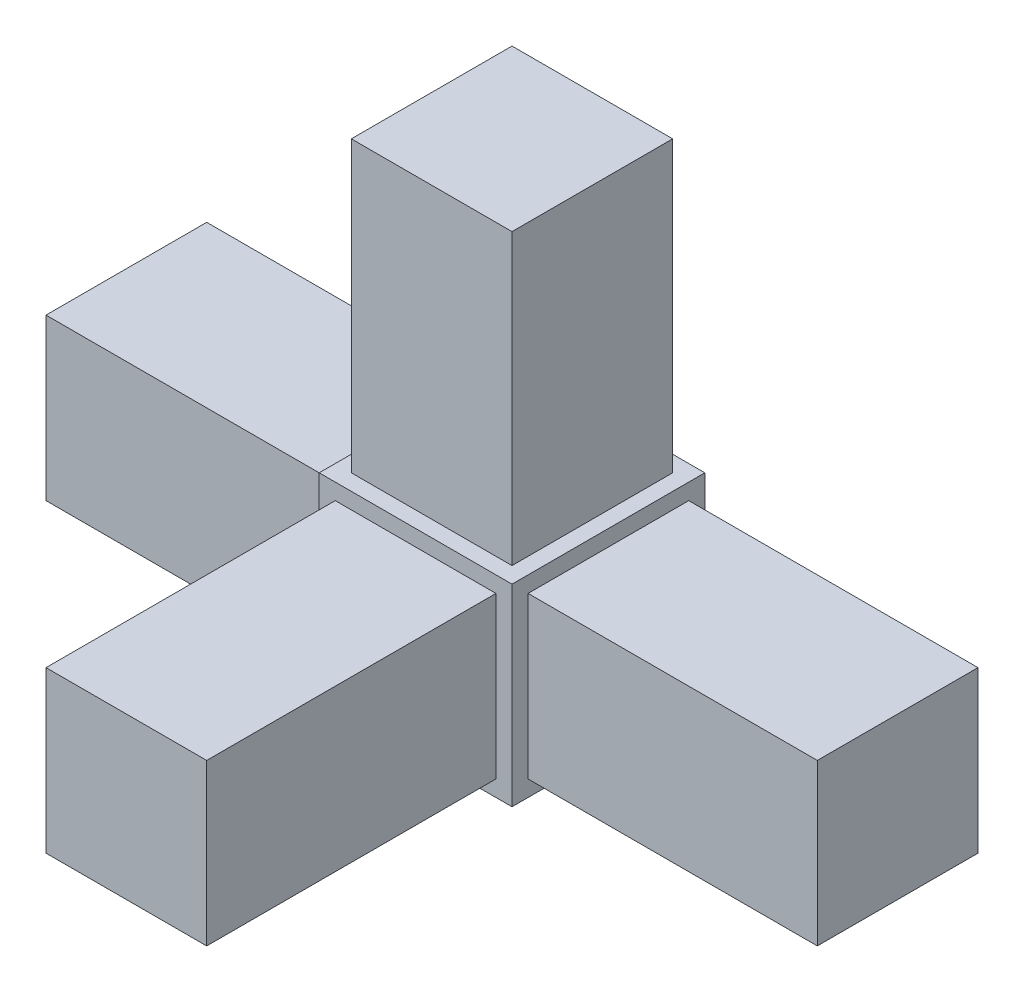
ISO-10303-21;
HEADER;
FILE_DESCRIPTION(('STEP AP214'),'2;1');
FILE_NAME('part.step','',(''),(''),'','','');
FILE_SCHEMA(('AUTOMOTIVE_DESIGN { 1 0 10303 214 1 1 1 1 }'));
ENDSEC;
DATA;
#1=APPLICATION_CONTEXT('core data for automotive mechanical design processes');
#2=APPLICATION_PROTOCOL_DEFINITION('international standard','automotive_design',2000,#1);
#3=PRODUCT_CONTEXT('',#1,'mechanical');
#4=PRODUCT('Part','Part','',(#3));
#5=PRODUCT_RELATED_PRODUCT_CATEGORY('part','',(#4));
#6=PRODUCT_DEFINITION_FORMATION('','',#4);
#7=PRODUCT_DEFINITION_CONTEXT('part definition',#1,'design');
#8=PRODUCT_DEFINITION('design','',#6,#7);
#9=PRODUCT_DEFINITION_SHAPE('','',#8);
#10=(LENGTH_UNIT() NAMED_UNIT(*) SI_UNIT(.MILLI.,.METRE.));
#11=(NAMED_UNIT(*) PLANE_ANGLE_UNIT() SI_UNIT($,.RADIAN.));
#12=(NAMED_UNIT(*) SI_UNIT($,.STERADIAN.) SOLID_ANGLE_UNIT());
#13=UNCERTAINTY_MEASURE_WITH_UNIT(LENGTH_MEASURE(1.E-05),#10,'distance_accuracy_value','');
#14=(GEOMETRIC_REPRESENTATION_CONTEXT(3) GLOBAL_UNCERTAINTY_ASSIGNED_CONTEXT((#13)) GLOBAL_UNIT_ASSIGNED_CONTEXT((#10,
#11,#12)) REPRESENTATION_CONTEXT('',''));
#15=CARTESIAN_POINT('',(0.,0.,0.));
#16=DIRECTION('',(0.,0.,1.));
#17=DIRECTION('',(1.,0.,0.));
#18=AXIS2_PLACEMENT_3D('',#15,#16,#17);
#19=CARTESIAN_POINT('',(-9.525,-9.525,19.05));
#20=DIRECTION('',(1.,0.,0.));
#21=DIRECTION('',(0.,0.,-1.));
#22=AXIS2_PLACEMENT_3D('',#19,#20,#21);
#23=PLANE('',#22);
#24=DIRECTION('',(0.,-1.,0.));
#25=VECTOR('',#24,1.);
#26=CARTESIAN_POINT('',(-9.525,-9.525,0.));
#27=LINE('',#26,#25);
#28=CARTESIAN_POINT('',(-9.525,9.525,0.));
#29=VERTEX_POINT('',#28);
#30=CARTESIAN_POINT('',(-9.525,-9.525,0.));
#31=VERTEX_POINT('',#30);
#32=EDGE_CURVE('E290',#29,#31,#27,.T.);
#33=ORIENTED_EDGE('',*,*,#32,.T.);
#34=DIRECTION('',(0.,0.,-1.));
#35=VECTOR('',#34,1.);
#36=CARTESIAN_POINT('',(-9.525,-9.525,19.05));
#37=LINE('',#36,#35);
#38=CARTESIAN_POINT('',(-9.525,-9.525,19.05));
#39=VERTEX_POINT('',#38);
#40=EDGE_CURVE('E11',#39,#31,#37,.T.);
#41=ORIENTED_EDGE('',*,*,#40,.F.);
#42=DIRECTION('',(0.,-1.,0.));
#43=VECTOR('',#42,1.);
#44=CARTESIAN_POINT('',(-9.525,-9.525,19.05));
#45=LINE('',#44,#43);
#46=CARTESIAN_POINT('',(-9.525,9.525,19.05));
#47=VERTEX_POINT('',#46);
#48=EDGE_CURVE('E291',#47,#39,#45,.T.);
#49=ORIENTED_EDGE('',*,*,#48,.F.);
#50=DIRECTION('',(0.,0.,-1.));
#51=VECTOR('',#50,1.);
#52=CARTESIAN_POINT('',(-9.525,9.525,19.05));
#53=LINE('',#52,#51);
#54=EDGE_CURVE('E301',#47,#29,#53,.T.);
#55=ORIENTED_EDGE('',*,*,#54,.T.);
#56=EDGE_LOOP('',(#33,#41,#49,#55));
#57=FACE_BOUND('',#56,.T.);
#58=DIRECTION('',(0.,-1.,0.));
#59=VECTOR('',#58,1.);
#60=CARTESIAN_POINT('',(-9.525,7.9375,1.5875));
#61=LINE('',#60,#59);
#62=CARTESIAN_POINT('',(-9.525,7.9375,1.5875));
#63=VERTEX_POINT('',#62);
#64=CARTESIAN_POINT('',(-9.525,-7.9375,1.58750000000001));
#65=VERTEX_POINT('',#64);
#66=EDGE_CURVE('E189',#63,#65,#61,.T.);
#67=ORIENTED_EDGE('',*,*,#66,.F.);
#68=DIRECTION('',(0.,0.,-1.));
#69=VECTOR('',#68,1.);
#70=CARTESIAN_POINT('',(-9.525,7.9375,1.5875));
#71=LINE('',#70,#69);
#72=CARTESIAN_POINT('',(-9.525,7.9375,17.4625));
#73=VERTEX_POINT('',#72);
#74=EDGE_CURVE('E186',#73,#63,#71,.T.);
#75=ORIENTED_EDGE('',*,*,#74,.F.);
#76=DIRECTION('',(0.,1.,0.));
#77=VECTOR('',#76,1.);
#78=CARTESIAN_POINT('',(-9.525,7.9375,17.4625));
#79=LINE('',#78,#77);
#80=CARTESIAN_POINT('',(-9.525,-7.9375,17.4625));
#81=VERTEX_POINT('',#80);
#82=EDGE_CURVE('E52',#81,#73,#79,.T.);
#83=ORIENTED_EDGE('',*,*,#82,.F.);
#84=DIRECTION('',(0.,0.,1.));
#85=VECTOR('',#84,1.);
#86=CARTESIAN_POINT('',(-9.525,-7.9375,1.58750000000001));
#87=LINE('',#86,#85);
#88=EDGE_CURVE('E47',#65,#81,#87,.T.);
#89=ORIENTED_EDGE('',*,*,#88,.F.);
#90=EDGE_LOOP('',(#67,#75,#83,#89));
#91=FACE_BOUND('',#90,.T.);
#92=ADVANCED_FACE('F33',(#57,#91),#23,.F.);
#93=CARTESIAN_POINT('',(0.,0.,19.05));
#94=DIRECTION('',(0.,0.,1.));
#95=DIRECTION('',(1.,0.,0.));
#96=AXIS2_PLACEMENT_3D('',#93,#94,#95);
#97=PLANE('',#96);
#98=ORIENTED_EDGE('',*,*,#48,.T.);
#99=DIRECTION('',(1.,0.,0.));
#100=VECTOR('',#99,1.);
#101=CARTESIAN_POINT('',(9.525,-9.525,19.05));
#102=LINE('',#101,#100);
#103=CARTESIAN_POINT('',(9.525,-9.525,19.05));
#104=VERTEX_POINT('',#103);
#105=EDGE_CURVE('E294',#39,#104,#102,.T.);
#106=ORIENTED_EDGE('',*,*,#105,.T.);
#107=DIRECTION('',(0.,1.,0.));
#108=VECTOR('',#107,1.);
#109=CARTESIAN_POINT('',(9.525,-9.525,19.05));
#110=LINE('',#109,#108);
#111=CARTESIAN_POINT('',(9.525,9.525,19.05));
#112=VERTEX_POINT('',#111);
#113=EDGE_CURVE('E297',#104,#112,#110,.T.);
#114=ORIENTED_EDGE('',*,*,#113,.T.);
#115=DIRECTION('',(-1.,0.,0.));
#116=VECTOR('',#115,1.);
#117=CARTESIAN_POINT('',(9.525,9.525,19.05));
#118=LINE('',#117,#116);
#119=EDGE_CURVE('E299',#112,#47,#118,.T.);
#120=ORIENTED_EDGE('',*,*,#119,.T.);
#121=EDGE_LOOP('',(#98,#106,#114,#120));
#122=FACE_BOUND('',#121,.T.);
#123=DIRECTION('',(1.,0.,0.));
#124=VECTOR('',#123,1.);
#125=CARTESIAN_POINT('',(7.9375,-7.9375,19.05));
#126=LINE('',#125,#124);
#127=CARTESIAN_POINT('',(-7.9375,-7.9375,19.05));
#128=VERTEX_POINT('',#127);
#129=CARTESIAN_POINT('',(7.9375,-7.9375,19.05));
#130=VERTEX_POINT('',#129);
#131=EDGE_CURVE('E193',#128,#130,#126,.T.);
#132=ORIENTED_EDGE('',*,*,#131,.F.);
#133=DIRECTION('',(0.,-1.,0.));
#134=VECTOR('',#133,1.);
#135=CARTESIAN_POINT('',(-7.9375,-7.9375,19.05));
#136=LINE('',#135,#134);
#137=CARTESIAN_POINT('',(-7.9375,7.9375,19.05));
#138=VERTEX_POINT('',#137);
#139=EDGE_CURVE('E190',#138,#128,#136,.T.);
#140=ORIENTED_EDGE('',*,*,#139,.F.);
#141=DIRECTION('',(-1.,0.,0.));
#142=VECTOR('',#141,1.);
#143=CARTESIAN_POINT('',(7.9375,7.9375,19.05));
#144=LINE('',#143,#142);
#145=CARTESIAN_POINT('',(7.9375,7.9375,19.05));
#146=VERTEX_POINT('',#145);
#147=EDGE_CURVE('E203',#146,#138,#144,.T.);
#148=ORIENTED_EDGE('',*,*,#147,.F.);
#149=DIRECTION('',(0.,1.,0.));
#150=VECTOR('',#149,1.);
#151=CARTESIAN_POINT('',(7.9375,-7.9375,19.05));
#152=LINE('',#151,#150);
#153=EDGE_CURVE('E211',#130,#146,#152,.T.);
#154=ORIENTED_EDGE('',*,*,#153,.F.);
#155=EDGE_LOOP('',(#132,#140,#148,#154));
#156=FACE_BOUND('',#155,.T.);
#157=ADVANCED_FACE('F335',(#122,#156),#97,.T.);
#158=CARTESIAN_POINT('',(9.525,-9.525,19.05));
#159=DIRECTION('',(-1.,0.,0.));
#160=DIRECTION('',(0.,0.,1.));
#161=AXIS2_PLACEMENT_3D('',#158,#159,#160);
#162=PLANE('',#161);
#163=DIRECTION('',(0.,1.,0.));
#164=VECTOR('',#163,1.);
#165=CARTESIAN_POINT('',(9.525,-9.525,0.));
#166=LINE('',#165,#164);
#167=CARTESIAN_POINT('',(9.525,-9.525,0.));
#168=VERTEX_POINT('',#167);
#169=CARTESIAN_POINT('',(9.525,9.525,0.));
#170=VERTEX_POINT('',#169);
#171=EDGE_CURVE('E306',#168,#170,#166,.T.);
#172=ORIENTED_EDGE('',*,*,#171,.T.);
#173=DIRECTION('',(0.,0.,-1.));
#174=VECTOR('',#173,1.);
#175=CARTESIAN_POINT('',(9.525,9.525,19.05));
#176=LINE('',#175,#174);
#177=EDGE_CURVE('E311',#112,#170,#176,.T.);
#178=ORIENTED_EDGE('',*,*,#177,.F.);
#179=ORIENTED_EDGE('',*,*,#113,.F.);
#180=DIRECTION('',(0.,0.,-1.));
#181=VECTOR('',#180,1.);
#182=CARTESIAN_POINT('',(9.525,-9.525,19.05));
#183=LINE('',#182,#181);
#184=EDGE_CURVE('E40',#104,#168,#183,.T.);
#185=ORIENTED_EDGE('',*,*,#184,.T.);
#186=EDGE_LOOP('',(#172,#178,#179,#185));
#187=FACE_BOUND('',#186,.T.);
#188=DIRECTION('',(0.,1.,0.));
#189=VECTOR('',#188,1.);
#190=CARTESIAN_POINT('',(9.525,-7.9375,1.5875));
#191=LINE('',#190,#189);
#192=CARTESIAN_POINT('',(9.525,-7.9375,1.5875));
#193=VERTEX_POINT('',#192);
#194=CARTESIAN_POINT('',(9.525,7.9375,1.5875));
#195=VERTEX_POINT('',#194);
#196=EDGE_CURVE('E224',#193,#195,#191,.T.);
#197=ORIENTED_EDGE('',*,*,#196,.F.);
#198=DIRECTION('',(0.,0.,-1.));
#199=VECTOR('',#198,1.);
#200=CARTESIAN_POINT('',(9.525,-7.9375,17.4625));
#201=LINE('',#200,#199);
#202=CARTESIAN_POINT('',(9.525,-7.9375,17.4625));
#203=VERTEX_POINT('',#202);
#204=EDGE_CURVE('E229',#203,#193,#201,.T.);
#205=ORIENTED_EDGE('',*,*,#204,.F.);
#206=DIRECTION('',(0.,-1.,0.));
#207=VECTOR('',#206,1.);
#208=CARTESIAN_POINT('',(9.525,-7.9375,17.4625));
#209=LINE('',#208,#207);
#210=CARTESIAN_POINT('',(9.525,7.9375,17.4625));
#211=VERTEX_POINT('',#210);
#212=EDGE_CURVE('E241',#211,#203,#209,.T.);
#213=ORIENTED_EDGE('',*,*,#212,.F.);
#214=DIRECTION('',(0.,0.,1.));
#215=VECTOR('',#214,1.);
#216=CARTESIAN_POINT('',(9.525,7.9375,17.4625));
#217=LINE('',#216,#215);
#218=EDGE_CURVE('E238',#195,#211,#217,.T.);
#219=ORIENTED_EDGE('',*,*,#218,.F.);
#220=EDGE_LOOP('',(#197,#205,#213,#219));
#221=FACE_BOUND('',#220,.T.);
#222=ADVANCED_FACE('F318',(#187,#221),#162,.F.);
#223=CARTESIAN_POINT('',(9.525,9.525,19.05));
#224=DIRECTION('',(0.,-1.,0.));
#225=DIRECTION('',(1.,0.,0.));
#226=AXIS2_PLACEMENT_3D('',#223,#224,#225);
#227=PLANE('',#226);
#228=DIRECTION('',(-1.,0.,0.));
#229=VECTOR('',#228,1.);
#230=CARTESIAN_POINT('',(9.525,9.525,0.));
#231=LINE('',#230,#229);
#232=EDGE_CURVE('E295',#170,#29,#231,.T.);
#233=ORIENTED_EDGE('',*,*,#232,.T.);
#234=ORIENTED_EDGE('',*,*,#54,.F.);
#235=ORIENTED_EDGE('',*,*,#119,.F.);
#236=ORIENTED_EDGE('',*,*,#177,.T.);
#237=EDGE_LOOP('',(#233,#234,#235,#236));
#238=FACE_BOUND('',#237,.T.);
#239=DIRECTION('',(0.,0.,-1.));
#240=VECTOR('',#239,1.);
#241=CARTESIAN_POINT('',(7.9375,9.525,1.5875));
#242=LINE('',#241,#240);
#243=CARTESIAN_POINT('',(7.9375,9.525,17.4625));
#244=VERTEX_POINT('',#243);
#245=CARTESIAN_POINT('',(7.9375,9.525,1.5875));
#246=VERTEX_POINT('',#245);
#247=EDGE_CURVE('E257',#244,#246,#242,.T.);
#248=ORIENTED_EDGE('',*,*,#247,.F.);
#249=DIRECTION('',(1.,0.,0.));
#250=VECTOR('',#249,1.);
#251=CARTESIAN_POINT('',(-7.9375,9.525,17.4625));
#252=LINE('',#251,#250);
#253=CARTESIAN_POINT('',(-7.9375,9.525,17.4625));
#254=VERTEX_POINT('',#253);
#255=EDGE_CURVE('E262',#254,#244,#252,.T.);
#256=ORIENTED_EDGE('',*,*,#255,.F.);
#257=DIRECTION('',(0.,0.,1.));
#258=VECTOR('',#257,1.);
#259=CARTESIAN_POINT('',(-7.9375,9.525,1.5875));
#260=LINE('',#259,#258);
#261=CARTESIAN_POINT('',(-7.9375,9.525,1.58750000000001));
#262=VERTEX_POINT('',#261);
#263=EDGE_CURVE('E274',#262,#254,#260,.T.);
#264=ORIENTED_EDGE('',*,*,#263,.F.);
#265=DIRECTION('',(-1.,0.,0.));
#266=VECTOR('',#265,1.);
#267=CARTESIAN_POINT('',(-7.9375,9.525,1.5875));
#268=LINE('',#267,#266);
#269=EDGE_CURVE('E271',#246,#262,#268,.T.);
#270=ORIENTED_EDGE('',*,*,#269,.F.);
#271=EDGE_LOOP('',(#248,#256,#264,#270));
#272=FACE_BOUND('',#271,.T.);
#273=ADVANCED_FACE('F328',(#238,#272),#227,.F.);
#274=CARTESIAN_POINT('',(9.525,-9.525,19.05));
#275=DIRECTION('',(0.,1.,0.));
#276=DIRECTION('',(-1.,0.,0.));
#277=AXIS2_PLACEMENT_3D('',#274,#275,#276);
#278=PLANE('',#277);
#279=DIRECTION('',(1.,0.,0.));
#280=VECTOR('',#279,1.);
#281=CARTESIAN_POINT('',(9.525,-9.525,0.));
#282=LINE('',#281,#280);
#283=EDGE_CURVE('E304',#31,#168,#282,.T.);
#284=ORIENTED_EDGE('',*,*,#283,.T.);
#285=ORIENTED_EDGE('',*,*,#184,.F.);
#286=ORIENTED_EDGE('',*,*,#105,.F.);
#287=ORIENTED_EDGE('',*,*,#40,.T.);
#288=EDGE_LOOP('',(#284,#285,#286,#287));
#289=FACE_BOUND('',#288,.T.);
#290=ADVANCED_FACE('F337',(#289),#278,.F.);
#291=CARTESIAN_POINT('',(0.,0.,0.));
#292=DIRECTION('',(0.,0.,1.));
#293=DIRECTION('',(1.,0.,0.));
#294=AXIS2_PLACEMENT_3D('',#291,#292,#293);
#295=PLANE('',#294);
#296=ORIENTED_EDGE('',*,*,#32,.F.);
#297=ORIENTED_EDGE('',*,*,#232,.F.);
#298=ORIENTED_EDGE('',*,*,#171,.F.);
#299=ORIENTED_EDGE('',*,*,#283,.F.);
#300=EDGE_LOOP('',(#296,#297,#298,#299));
#301=FACE_BOUND('',#300,.T.);
#302=ADVANCED_FACE('F325',(#301),#295,.F.);
#303=CARTESIAN_POINT('',(7.9375,38.1,1.5875));
#304=DIRECTION('',(-1.,0.,0.));
#305=DIRECTION('',(0.,0.,1.));
#306=AXIS2_PLACEMENT_3D('',#303,#304,#305);
#307=PLANE('',#306);
#308=ORIENTED_EDGE('',*,*,#247,.T.);
#309=DIRECTION('',(0.,-1.,0.));
#310=VECTOR('',#309,1.);
#311=CARTESIAN_POINT('',(7.9375,38.1,1.5875));
#312=LINE('',#311,#310);
#313=CARTESIAN_POINT('',(7.9375,38.1,1.5875));
#314=VERTEX_POINT('',#313);
#315=EDGE_CURVE('E287',#314,#246,#312,.T.);
#316=ORIENTED_EDGE('',*,*,#315,.F.);
#317=DIRECTION('',(0.,0.,-1.));
#318=VECTOR('',#317,1.);
#319=CARTESIAN_POINT('',(7.9375,38.1,1.5875));
#320=LINE('',#319,#318);
#321=CARTESIAN_POINT('',(7.9375,38.1,17.4625));
#322=VERTEX_POINT('',#321);
#323=EDGE_CURVE('E258',#322,#314,#320,.T.);
#324=ORIENTED_EDGE('',*,*,#323,.F.);
#325=DIRECTION('',(0.,-1.,0.));
#326=VECTOR('',#325,1.);
#327=CARTESIAN_POINT('',(7.9375,38.1,17.4625));
#328=LINE('',#327,#326);
#329=EDGE_CURVE('E268',#322,#244,#328,.T.);
#330=ORIENTED_EDGE('',*,*,#329,.T.);
#331=EDGE_LOOP('',(#308,#316,#324,#330));
#332=FACE_BOUND('',#331,.T.);
#333=ADVANCED_FACE('F343',(#332),#307,.F.);
#334=CARTESIAN_POINT('',(-7.9375,38.1,1.5875));
#335=DIRECTION('',(0.,0.,1.));
#336=DIRECTION('',(1.,0.,0.));
#337=AXIS2_PLACEMENT_3D('',#334,#335,#336);
#338=PLANE('',#337);
#339=ORIENTED_EDGE('',*,*,#269,.T.);
#340=DIRECTION('',(0.,-1.,0.));
#341=VECTOR('',#340,1.);
#342=CARTESIAN_POINT('',(-7.9375,38.1,1.5875));
#343=LINE('',#342,#341);
#344=CARTESIAN_POINT('',(-7.9375,38.1,1.5875));
#345=VERTEX_POINT('',#344);
#346=EDGE_CURVE('E284',#345,#262,#343,.T.);
#347=ORIENTED_EDGE('',*,*,#346,.F.);
#348=DIRECTION('',(-1.,0.,0.));
#349=VECTOR('',#348,1.);
#350=CARTESIAN_POINT('',(-7.9375,38.1,1.5875));
#351=LINE('',#350,#349);
#352=EDGE_CURVE('E261',#314,#345,#351,.T.);
#353=ORIENTED_EDGE('',*,*,#352,.F.);
#354=ORIENTED_EDGE('',*,*,#315,.T.);
#355=EDGE_LOOP('',(#339,#347,#353,#354));
#356=FACE_BOUND('',#355,.T.);
#357=ADVANCED_FACE('F358',(#356),#338,.F.);
#358=CARTESIAN_POINT('',(-7.9375,38.1,1.5875));
#359=DIRECTION('',(1.,0.,0.));
#360=DIRECTION('',(0.,0.,-1.));
#361=AXIS2_PLACEMENT_3D('',#358,#359,#360);
#362=PLANE('',#361);
#363=ORIENTED_EDGE('',*,*,#263,.T.);
#364=DIRECTION('',(0.,-1.,0.));
#365=VECTOR('',#364,1.);
#366=CARTESIAN_POINT('',(-7.9375,38.1,17.4625));
#367=LINE('',#366,#365);
#368=CARTESIAN_POINT('',(-7.9375,38.1,17.4625));
#369=VERTEX_POINT('',#368);
#370=EDGE_CURVE('E281',#369,#254,#367,.T.);
#371=ORIENTED_EDGE('',*,*,#370,.F.);
#372=DIRECTION('',(0.,0.,1.));
#373=VECTOR('',#372,1.);
#374=CARTESIAN_POINT('',(-7.9375,38.1,1.5875));
#375=LINE('',#374,#373);
#376=EDGE_CURVE('E264',#345,#369,#375,.T.);
#377=ORIENTED_EDGE('',*,*,#376,.F.);
#378=ORIENTED_EDGE('',*,*,#346,.T.);
#379=EDGE_LOOP('',(#363,#371,#377,#378));
#380=FACE_BOUND('',#379,.T.);
#381=ADVANCED_FACE('F362',(#380),#362,.F.);
#382=CARTESIAN_POINT('',(-7.9375,38.1,17.4625));
#383=DIRECTION('',(0.,0.,-1.));
#384=DIRECTION('',(-1.,0.,0.));
#385=AXIS2_PLACEMENT_3D('',#382,#383,#384);
#386=PLANE('',#385);
#387=ORIENTED_EDGE('',*,*,#255,.T.);
#388=ORIENTED_EDGE('',*,*,#329,.F.);
#389=DIRECTION('',(1.,0.,0.));
#390=VECTOR('',#389,1.);
#391=CARTESIAN_POINT('',(-7.9375,38.1,17.4625));
#392=LINE('',#391,#390);
#393=EDGE_CURVE('E266',#369,#322,#392,.T.);
#394=ORIENTED_EDGE('',*,*,#393,.F.);
#395=ORIENTED_EDGE('',*,*,#370,.T.);
#396=EDGE_LOOP('',(#387,#388,#394,#395));
#397=FACE_BOUND('',#396,.T.);
#398=ADVANCED_FACE('F366',(#397),#386,.F.);
#399=CARTESIAN_POINT('',(0.,38.1,0.));
#400=DIRECTION('',(0.,1.,0.));
#401=DIRECTION('',(0.,0.,1.));
#402=AXIS2_PLACEMENT_3D('',#399,#400,#401);
#403=PLANE('',#402);
#404=ORIENTED_EDGE('',*,*,#323,.T.);
#405=ORIENTED_EDGE('',*,*,#352,.T.);
#406=ORIENTED_EDGE('',*,*,#376,.T.);
#407=ORIENTED_EDGE('',*,*,#393,.T.);
#408=EDGE_LOOP('',(#404,#405,#406,#407));
#409=FACE_BOUND('',#408,.T.);
#410=ADVANCED_FACE('F370',(#409),#403,.T.);
#411=CARTESIAN_POINT('',(38.1,-7.9375,1.5875));
#412=DIRECTION('',(0.,0.,1.));
#413=DIRECTION('',(1.,0.,0.));
#414=AXIS2_PLACEMENT_3D('',#411,#412,#413);
#415=PLANE('',#414);
#416=ORIENTED_EDGE('',*,*,#196,.T.);
#417=DIRECTION('',(-1.,0.,0.));
#418=VECTOR('',#417,1.);
#419=CARTESIAN_POINT('',(38.1,7.9375,1.5875));
#420=LINE('',#419,#418);
#421=CARTESIAN_POINT('',(38.1,7.9375,1.5875));
#422=VERTEX_POINT('',#421);
#423=EDGE_CURVE('E254',#422,#195,#420,.T.);
#424=ORIENTED_EDGE('',*,*,#423,.F.);
#425=DIRECTION('',(0.,1.,0.));
#426=VECTOR('',#425,1.);
#427=CARTESIAN_POINT('',(38.1,-7.9375,1.5875));
#428=LINE('',#427,#426);
#429=CARTESIAN_POINT('',(38.1,-7.9375,1.5875));
#430=VERTEX_POINT('',#429);
#431=EDGE_CURVE('E225',#430,#422,#428,.T.);
#432=ORIENTED_EDGE('',*,*,#431,.F.);
#433=DIRECTION('',(-1.,0.,0.));
#434=VECTOR('',#433,1.);
#435=CARTESIAN_POINT('',(38.1,-7.9375,1.5875));
#436=LINE('',#435,#434);
#437=EDGE_CURVE('E235',#430,#193,#436,.T.);
#438=ORIENTED_EDGE('',*,*,#437,.T.);
#439=EDGE_LOOP('',(#416,#424,#432,#438));
#440=FACE_BOUND('',#439,.T.);
#441=ADVANCED_FACE('F374',(#440),#415,.F.);
#442=CARTESIAN_POINT('',(38.1,7.9375,17.4625));
#443=DIRECTION('',(0.,-1.,0.));
#444=DIRECTION('',(0.,0.,-1.));
#445=AXIS2_PLACEMENT_3D('',#442,#443,#444);
#446=PLANE('',#445);
#447=ORIENTED_EDGE('',*,*,#218,.T.);
#448=DIRECTION('',(-1.,0.,0.));
#449=VECTOR('',#448,1.);
#450=CARTESIAN_POINT('',(38.1,7.9375,17.4625));
#451=LINE('',#450,#449);
#452=CARTESIAN_POINT('',(38.1,7.9375,17.4625));
#453=VERTEX_POINT('',#452);
#454=EDGE_CURVE('E251',#453,#211,#451,.T.);
#455=ORIENTED_EDGE('',*,*,#454,.F.);
#456=DIRECTION('',(0.,0.,1.));
#457=VECTOR('',#456,1.);
#458=CARTESIAN_POINT('',(38.1,7.9375,17.4625));
#459=LINE('',#458,#457);
#460=EDGE_CURVE('E228',#422,#453,#459,.T.);
#461=ORIENTED_EDGE('',*,*,#460,.F.);
#462=ORIENTED_EDGE('',*,*,#423,.T.);
#463=EDGE_LOOP('',(#447,#455,#461,#462));
#464=FACE_BOUND('',#463,.T.);
#465=ADVANCED_FACE('F378',(#464),#446,.F.);
#466=CARTESIAN_POINT('',(38.1,-7.9375,17.4625));
#467=DIRECTION('',(0.,0.,-1.));
#468=DIRECTION('',(-1.,0.,0.));
#469=AXIS2_PLACEMENT_3D('',#466,#467,#468);
#470=PLANE('',#469);
#471=ORIENTED_EDGE('',*,*,#212,.T.);
#472=DIRECTION('',(-1.,0.,0.));
#473=VECTOR('',#472,1.);
#474=CARTESIAN_POINT('',(38.1,-7.9375,17.4625));
#475=LINE('',#474,#473);
#476=CARTESIAN_POINT('',(38.1,-7.9375,17.4625));
#477=VERTEX_POINT('',#476);
#478=EDGE_CURVE('E248',#477,#203,#475,.T.);
#479=ORIENTED_EDGE('',*,*,#478,.F.);
#480=DIRECTION('',(0.,-1.,0.));
#481=VECTOR('',#480,1.);
#482=CARTESIAN_POINT('',(38.1,-7.9375,17.4625));
#483=LINE('',#482,#481);
#484=EDGE_CURVE('E231',#453,#477,#483,.T.);
#485=ORIENTED_EDGE('',*,*,#484,.F.);
#486=ORIENTED_EDGE('',*,*,#454,.T.);
#487=EDGE_LOOP('',(#471,#479,#485,#486));
#488=FACE_BOUND('',#487,.T.);
#489=ADVANCED_FACE('F382',(#488),#470,.F.);
#490=CARTESIAN_POINT('',(38.1,-7.9375,17.4625));
#491=DIRECTION('',(0.,1.,0.));
#492=DIRECTION('',(0.,0.,1.));
#493=AXIS2_PLACEMENT_3D('',#490,#491,#492);
#494=PLANE('',#493);
#495=ORIENTED_EDGE('',*,*,#204,.T.);
#496=ORIENTED_EDGE('',*,*,#437,.F.);
#497=DIRECTION('',(0.,0.,-1.));
#498=VECTOR('',#497,1.);
#499=CARTESIAN_POINT('',(38.1,-7.9375,17.4625));
#500=LINE('',#499,#498);
#501=EDGE_CURVE('E233',#477,#430,#500,.T.);
#502=ORIENTED_EDGE('',*,*,#501,.F.);
#503=ORIENTED_EDGE('',*,*,#478,.T.);
#504=EDGE_LOOP('',(#495,#496,#502,#503));
#505=FACE_BOUND('',#504,.T.);
#506=ADVANCED_FACE('F386',(#505),#494,.F.);
#507=CARTESIAN_POINT('',(38.1,0.,0.));
#508=DIRECTION('',(-1.,0.,0.));
#509=DIRECTION('',(0.,0.,1.));
#510=AXIS2_PLACEMENT_3D('',#507,#508,#509);
#511=PLANE('',#510);
#512=ORIENTED_EDGE('',*,*,#431,.T.);
#513=ORIENTED_EDGE('',*,*,#460,.T.);
#514=ORIENTED_EDGE('',*,*,#484,.T.);
#515=ORIENTED_EDGE('',*,*,#501,.T.);
#516=EDGE_LOOP('',(#512,#513,#514,#515));
#517=FACE_BOUND('',#516,.T.);
#518=ADVANCED_FACE('F390',(#517),#511,.F.);
#519=CARTESIAN_POINT('',(-7.9375,-7.9375,47.625));
#520=DIRECTION('',(1.,0.,0.));
#521=DIRECTION('',(0.,0.,-1.));
#522=AXIS2_PLACEMENT_3D('',#519,#520,#521);
#523=PLANE('',#522);
#524=ORIENTED_EDGE('',*,*,#139,.T.);
#525=DIRECTION('',(0.,0.,-1.));
#526=VECTOR('',#525,1.);
#527=CARTESIAN_POINT('',(-7.9375,-7.9375,47.625));
#528=LINE('',#527,#526);
#529=CARTESIAN_POINT('',(-7.9375,-7.9375,47.625));
#530=VERTEX_POINT('',#529);
#531=EDGE_CURVE('E222',#530,#128,#528,.T.);
#532=ORIENTED_EDGE('',*,*,#531,.F.);
#533=DIRECTION('',(0.,-1.,0.));
#534=VECTOR('',#533,1.);
#535=CARTESIAN_POINT('',(-7.9375,-7.9375,47.625));
#536=LINE('',#535,#534);
#537=CARTESIAN_POINT('',(-7.9375,7.9375,47.625));
#538=VERTEX_POINT('',#537);
#539=EDGE_CURVE('E199',#538,#530,#536,.T.);
#540=ORIENTED_EDGE('',*,*,#539,.F.);
#541=DIRECTION('',(0.,0.,-1.));
#542=VECTOR('',#541,1.);
#543=CARTESIAN_POINT('',(-7.9375,7.9375,47.625));
#544=LINE('',#543,#542);
#545=EDGE_CURVE('E208',#538,#138,#544,.T.);
#546=ORIENTED_EDGE('',*,*,#545,.T.);
#547=EDGE_LOOP('',(#524,#532,#540,#546));
#548=FACE_BOUND('',#547,.T.);
#549=ADVANCED_FACE('F394',(#548),#523,.F.);
#550=CARTESIAN_POINT('',(7.9375,-7.9375,47.625));
#551=DIRECTION('',(0.,1.,0.));
#552=DIRECTION('',(-1.,0.,0.));
#553=AXIS2_PLACEMENT_3D('',#550,#551,#552);
#554=PLANE('',#553);
#555=ORIENTED_EDGE('',*,*,#131,.T.);
#556=DIRECTION('',(0.,0.,-1.));
#557=VECTOR('',#556,1.);
#558=CARTESIAN_POINT('',(7.9375,-7.9375,47.625));
#559=LINE('',#558,#557);
#560=CARTESIAN_POINT('',(7.9375,-7.9375,47.625));
#561=VERTEX_POINT('',#560);
#562=EDGE_CURVE('E219',#561,#130,#559,.T.);
#563=ORIENTED_EDGE('',*,*,#562,.F.);
#564=DIRECTION('',(1.,0.,0.));
#565=VECTOR('',#564,1.);
#566=CARTESIAN_POINT('',(7.9375,-7.9375,47.625));
#567=LINE('',#566,#565);
#568=EDGE_CURVE('E202',#530,#561,#567,.T.);
#569=ORIENTED_EDGE('',*,*,#568,.F.);
#570=ORIENTED_EDGE('',*,*,#531,.T.);
#571=EDGE_LOOP('',(#555,#563,#569,#570));
#572=FACE_BOUND('',#571,.T.);
#573=ADVANCED_FACE('F398',(#572),#554,.F.);
#574=CARTESIAN_POINT('',(7.9375,-7.9375,47.625));
#575=DIRECTION('',(-1.,0.,0.));
#576=DIRECTION('',(0.,0.,1.));
#577=AXIS2_PLACEMENT_3D('',#574,#575,#576);
#578=PLANE('',#577);
#579=ORIENTED_EDGE('',*,*,#153,.T.);
#580=DIRECTION('',(0.,0.,-1.));
#581=VECTOR('',#580,1.);
#582=CARTESIAN_POINT('',(7.9375,7.9375,47.625));
#583=LINE('',#582,#581);
#584=CARTESIAN_POINT('',(7.9375,7.9375,47.625));
#585=VERTEX_POINT('',#584);
#586=EDGE_CURVE('E217',#585,#146,#583,.T.);
#587=ORIENTED_EDGE('',*,*,#586,.F.);
#588=DIRECTION('',(0.,1.,0.));
#589=VECTOR('',#588,1.);
#590=CARTESIAN_POINT('',(7.9375,-7.9375,47.625));
#591=LINE('',#590,#589);
#592=EDGE_CURVE('E205',#561,#585,#591,.T.);
#593=ORIENTED_EDGE('',*,*,#592,.F.);
#594=ORIENTED_EDGE('',*,*,#562,.T.);
#595=EDGE_LOOP('',(#579,#587,#593,#594));
#596=FACE_BOUND('',#595,.T.);
#597=ADVANCED_FACE('F402',(#596),#578,.F.);
#598=CARTESIAN_POINT('',(7.9375,7.9375,47.625));
#599=DIRECTION('',(0.,-1.,0.));
#600=DIRECTION('',(0.,0.,-1.));
#601=AXIS2_PLACEMENT_3D('',#598,#599,#600);
#602=PLANE('',#601);
#603=ORIENTED_EDGE('',*,*,#147,.T.);
#604=ORIENTED_EDGE('',*,*,#545,.F.);
#605=DIRECTION('',(-1.,0.,0.));
#606=VECTOR('',#605,1.);
#607=CARTESIAN_POINT('',(7.9375,7.9375,47.625));
#608=LINE('',#607,#606);
#609=EDGE_CURVE('E207',#585,#538,#608,.T.);
#610=ORIENTED_EDGE('',*,*,#609,.F.);
#611=ORIENTED_EDGE('',*,*,#586,.T.);
#612=EDGE_LOOP('',(#603,#604,#610,#611));
#613=FACE_BOUND('',#612,.T.);
#614=ADVANCED_FACE('F406',(#613),#602,.F.);
#615=CARTESIAN_POINT('',(0.,0.,47.625));
#616=DIRECTION('',(0.,0.,1.));
#617=DIRECTION('',(1.,0.,0.));
#618=AXIS2_PLACEMENT_3D('',#615,#616,#617);
#619=PLANE('',#618);
#620=ORIENTED_EDGE('',*,*,#539,.T.);
#621=ORIENTED_EDGE('',*,*,#568,.T.);
#622=ORIENTED_EDGE('',*,*,#592,.T.);
#623=ORIENTED_EDGE('',*,*,#609,.T.);
#624=EDGE_LOOP('',(#620,#621,#622,#623));
#625=FACE_BOUND('',#624,.T.);
#626=ADVANCED_FACE('F410',(#625),#619,.T.);
#627=CARTESIAN_POINT('',(-38.1,7.9375,1.5875));
#628=DIRECTION('',(0.,0.,1.));
#629=DIRECTION('',(0.,-1.,0.));
#630=AXIS2_PLACEMENT_3D('',#627,#628,#629);
#631=PLANE('',#630);
#632=ORIENTED_EDGE('',*,*,#66,.T.);
#633=DIRECTION('',(1.,0.,0.));
#634=VECTOR('',#633,1.);
#635=CARTESIAN_POINT('',(-38.1,-7.9375,1.58750000000001));
#636=LINE('',#635,#634);
#637=CARTESIAN_POINT('',(-38.1,-7.9375,1.58750000000001));
#638=VERTEX_POINT('',#637);
#639=EDGE_CURVE('E170',#638,#65,#636,.T.);
#640=ORIENTED_EDGE('',*,*,#639,.F.);
#641=DIRECTION('',(0.,-1.,0.));
#642=VECTOR('',#641,1.);
#643=CARTESIAN_POINT('',(-38.1,7.9375,1.5875));
#644=LINE('',#643,#642);
#645=CARTESIAN_POINT('',(-38.1,7.9375,1.5875));
#646=VERTEX_POINT('',#645);
#647=EDGE_CURVE('E177',#646,#638,#644,.T.);
#648=ORIENTED_EDGE('',*,*,#647,.F.);
#649=DIRECTION('',(1.,0.,0.));
#650=VECTOR('',#649,1.);
#651=CARTESIAN_POINT('',(-38.1,7.9375,1.5875));
#652=LINE('',#651,#650);
#653=EDGE_CURVE('E580',#646,#63,#652,.T.);
#654=ORIENTED_EDGE('',*,*,#653,.T.);
#655=EDGE_LOOP('',(#632,#640,#648,#654));
#656=FACE_BOUND('',#655,.T.);
#657=ADVANCED_FACE('F188',(#656),#631,.F.);
#658=CARTESIAN_POINT('',(-38.1,-7.9375,1.58750000000001));
#659=DIRECTION('',(0.,1.,0.));
#660=DIRECTION('',(0.,0.,1.));
#661=AXIS2_PLACEMENT_3D('',#658,#659,#660);
#662=PLANE('',#661);
#663=ORIENTED_EDGE('',*,*,#88,.T.);
#664=DIRECTION('',(1.,0.,0.));
#665=VECTOR('',#664,1.);
#666=CARTESIAN_POINT('',(-38.1,-7.9375,17.4625));
#667=LINE('',#666,#665);
#668=CARTESIAN_POINT('',(-38.1,-7.9375,17.4625));
#669=VERTEX_POINT('',#668);
#670=EDGE_CURVE('E173',#669,#81,#667,.T.);
#671=ORIENTED_EDGE('',*,*,#670,.F.);
#672=DIRECTION('',(0.,0.,1.));
#673=VECTOR('',#672,1.);
#674=CARTESIAN_POINT('',(-38.1,-7.9375,1.58750000000001));
#675=LINE('',#674,#673);
#676=EDGE_CURVE('E166',#638,#669,#675,.T.);
#677=ORIENTED_EDGE('',*,*,#676,.F.);
#678=ORIENTED_EDGE('',*,*,#639,.T.);
#679=EDGE_LOOP('',(#663,#671,#677,#678));
#680=FACE_BOUND('',#679,.T.);
#681=ADVANCED_FACE('F168',(#680),#662,.F.);
#682=CARTESIAN_POINT('',(-38.1,7.9375,17.4625));
#683=DIRECTION('',(0.,0.,-1.));
#684=DIRECTION('',(0.,1.,0.));
#685=AXIS2_PLACEMENT_3D('',#682,#683,#684);
#686=PLANE('',#685);
#687=ORIENTED_EDGE('',*,*,#82,.T.);
#688=DIRECTION('',(1.,0.,0.));
#689=VECTOR('',#688,1.);
#690=CARTESIAN_POINT('',(-38.1,7.9375,17.4625));
#691=LINE('',#690,#689);
#692=CARTESIAN_POINT('',(-38.1,7.9375,17.4625));
#693=VERTEX_POINT('',#692);
#694=EDGE_CURVE('E195',#693,#73,#691,.T.);
#695=ORIENTED_EDGE('',*,*,#694,.F.);
#696=DIRECTION('',(0.,1.,0.));
#697=VECTOR('',#696,1.);
#698=CARTESIAN_POINT('',(-38.1,7.9375,17.4625));
#699=LINE('',#698,#697);
#700=EDGE_CURVE('E176',#669,#693,#699,.T.);
#701=ORIENTED_EDGE('',*,*,#700,.F.);
#702=ORIENTED_EDGE('',*,*,#670,.T.);
#703=EDGE_LOOP('',(#687,#695,#701,#702));
#704=FACE_BOUND('',#703,.T.);
#705=ADVANCED_FACE('F419',(#704),#686,.F.);
#706=CARTESIAN_POINT('',(-38.1,7.9375,1.5875));
#707=DIRECTION('',(0.,-1.,0.));
#708=DIRECTION('',(0.,0.,-1.));
#709=AXIS2_PLACEMENT_3D('',#706,#707,#708);
#710=PLANE('',#709);
#711=ORIENTED_EDGE('',*,*,#74,.T.);
#712=ORIENTED_EDGE('',*,*,#653,.F.);
#713=DIRECTION('',(0.,0.,-1.));
#714=VECTOR('',#713,1.);
#715=CARTESIAN_POINT('',(-38.1,7.9375,1.5875));
#716=LINE('',#715,#714);
#717=EDGE_CURVE('E182',#693,#646,#716,.T.);
#718=ORIENTED_EDGE('',*,*,#717,.F.);
#719=ORIENTED_EDGE('',*,*,#694,.T.);
#720=EDGE_LOOP('',(#711,#712,#718,#719));
#721=FACE_BOUND('',#720,.T.);
#722=ADVANCED_FACE('F422',(#721),#710,.F.);
#723=CARTESIAN_POINT('',(-38.1,0.,0.));
#724=DIRECTION('',(-1.,0.,0.));
#725=DIRECTION('',(0.,0.,1.));
#726=AXIS2_PLACEMENT_3D('',#723,#724,#725);
#727=PLANE('',#726);
#728=ORIENTED_EDGE('',*,*,#647,.T.);
#729=ORIENTED_EDGE('',*,*,#676,.T.);
#730=ORIENTED_EDGE('',*,*,#700,.T.);
#731=ORIENTED_EDGE('',*,*,#717,.T.);
#732=EDGE_LOOP('',(#728,#729,#730,#731));
#733=FACE_BOUND('',#732,.T.);
#734=ADVANCED_FACE('F180',(#733),#727,.T.);
#735=CLOSED_SHELL('',(#92,#157,#222,#273,#290,#302,#333,#357,#381,#398,#410,#441,#465,#489,#506,
#518,#549,#573,#597,#614,#626,#657,#681,#705,#722,#734));
#736=MANIFOLD_SOLID_BREP('B2',#735);
#737=ADVANCED_BREP_SHAPE_REPRESENTATION('',(#18,#736),#14);
#738=SHAPE_DEFINITION_REPRESENTATION(#9,#737);
ENDSEC;
END-ISO-10303-21;
